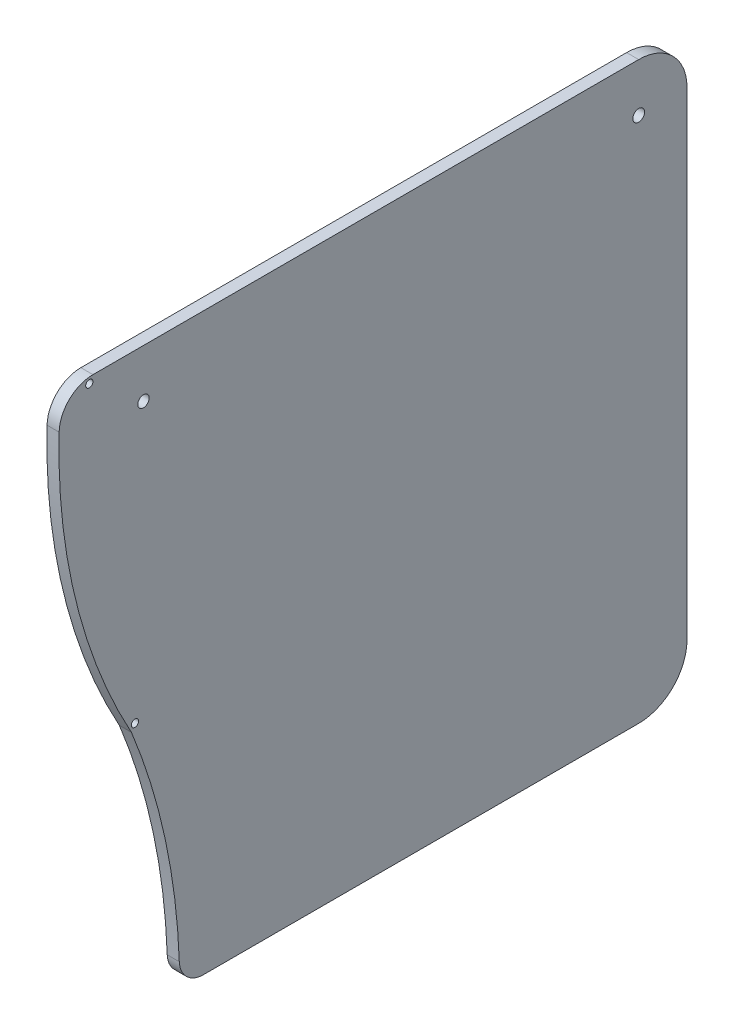
ISO-10303-21;
HEADER;
FILE_DESCRIPTION(('STEP AP214'),'2;1');
FILE_NAME('part.step','',(''),(''),'','','');
FILE_SCHEMA(('AUTOMOTIVE_DESIGN { 1 0 10303 214 1 1 1 1 }'));
ENDSEC;
DATA;
#1=APPLICATION_CONTEXT('core data for automotive mechanical design processes');
#2=APPLICATION_PROTOCOL_DEFINITION('international standard','automotive_design',2000,#1);
#3=PRODUCT_CONTEXT('',#1,'mechanical');
#4=PRODUCT('Part','Part','',(#3));
#5=PRODUCT_RELATED_PRODUCT_CATEGORY('part','',(#4));
#6=PRODUCT_DEFINITION_FORMATION('','',#4);
#7=PRODUCT_DEFINITION_CONTEXT('part definition',#1,'design');
#8=PRODUCT_DEFINITION('design','',#6,#7);
#9=PRODUCT_DEFINITION_SHAPE('','',#8);
#10=(LENGTH_UNIT() NAMED_UNIT(*) SI_UNIT(.MILLI.,.METRE.));
#11=(NAMED_UNIT(*) PLANE_ANGLE_UNIT() SI_UNIT($,.RADIAN.));
#12=(NAMED_UNIT(*) SI_UNIT($,.STERADIAN.) SOLID_ANGLE_UNIT());
#13=UNCERTAINTY_MEASURE_WITH_UNIT(LENGTH_MEASURE(1.E-05),#10,'distance_accuracy_value','');
#14=(GEOMETRIC_REPRESENTATION_CONTEXT(3) GLOBAL_UNCERTAINTY_ASSIGNED_CONTEXT((#13)) GLOBAL_UNIT_ASSIGNED_CONTEXT((#10,
#11,#12)) REPRESENTATION_CONTEXT('',''));
#15=CARTESIAN_POINT('',(0.,0.,0.));
#16=DIRECTION('',(0.,0.,1.));
#17=DIRECTION('',(1.,0.,0.));
#18=AXIS2_PLACEMENT_3D('',#15,#16,#17);
#19=CARTESIAN_POINT('',(3.175,0.,0.));
#20=DIRECTION('',(1.,0.,0.));
#21=DIRECTION('',(0.,0.,-1.));
#22=AXIS2_PLACEMENT_3D('',#19,#20,#21);
#23=PLANE('',#22);
#24=CARTESIAN_POINT('',(3.175,73.9775,74.5619158638602));
#25=DIRECTION('',(1.,0.,0.));
#26=DIRECTION('',(0.,0.,-1.));
#27=AXIS2_PLACEMENT_3D('',#24,#25,#26);
#28=CIRCLE('',#27,0.952499999999996);
#29=CARTESIAN_POINT('',(3.175,73.9775,73.6094158638602));
#30=VERTEX_POINT('',#29);
#31=EDGE_CURVE('E219',#30,#30,#28,.T.);
#32=ORIENTED_EDGE('',*,*,#31,.F.);
#33=EDGE_LOOP('',(#32));
#34=FACE_BOUND('',#33,.T.);
#35=CARTESIAN_POINT('',(3.175,-9.31335011248837,62.5720645796578));
#36=DIRECTION('',(1.,0.,0.));
#37=DIRECTION('',(0.,0.,-1.));
#38=AXIS2_PLACEMENT_3D('',#35,#36,#37);
#39=CIRCLE('',#38,0.952499999999996);
#40=CARTESIAN_POINT('',(3.175,-9.31335011248837,61.6195645796578));
#41=VERTEX_POINT('',#40);
#42=EDGE_CURVE('E213',#41,#41,#39,.T.);
#43=ORIENTED_EDGE('',*,*,#42,.F.);
#44=EDGE_LOOP('',(#43));
#45=FACE_BOUND('',#44,.T.);
#46=CARTESIAN_POINT('',(3.175,62.865,60.325));
#47=DIRECTION('',(1.,0.,0.));
#48=DIRECTION('',(0.,0.,-1.));
#49=AXIS2_PLACEMENT_3D('',#46,#47,#48);
#50=CIRCLE('',#49,1.5);
#51=CARTESIAN_POINT('',(3.175,62.865,58.825));
#52=VERTEX_POINT('',#51);
#53=EDGE_CURVE('E205',#52,#52,#50,.T.);
#54=ORIENTED_EDGE('',*,*,#53,.F.);
#55=EDGE_LOOP('',(#54));
#56=FACE_BOUND('',#55,.T.);
#57=CARTESIAN_POINT('',(3.175,62.865,-69.85));
#58=DIRECTION('',(1.,0.,0.));
#59=DIRECTION('',(0.,0.,-1.));
#60=AXIS2_PLACEMENT_3D('',#57,#58,#59);
#61=CIRCLE('',#60,1.54999999999999);
#62=CARTESIAN_POINT('',(3.175,62.865,-71.4));
#63=VERTEX_POINT('',#62);
#64=EDGE_CURVE('E152',#63,#63,#61,.T.);
#65=ORIENTED_EDGE('',*,*,#64,.F.);
#66=EDGE_LOOP('',(#65));
#67=FACE_BOUND('',#66,.T.);
#68=CARTESIAN_POINT('',(3.175,-75.565,221.70037307676));
#69=DIRECTION('',(1.,0.,0.));
#70=DIRECTION('',(0.,0.,-1.));
#71=AXIS2_PLACEMENT_3D('',#68,#69,#70);
#72=CIRCLE('',#71,170.90037307676);
#73=CARTESIAN_POINT('',(3.175,-69.4424889429008,50.909704783286));
#74=VERTEX_POINT('',#73);
#75=CARTESIAN_POINT('',(3.175,-10.9153327452514,63.5));
#76=VERTEX_POINT('',#75);
#77=EDGE_CURVE('E135',#74,#76,#72,.T.);
#78=ORIENTED_EDGE('',*,*,#77,.F.);
#79=CARTESIAN_POINT('',(3.175,-69.215,44.5637809907355));
#80=DIRECTION('',(1.,0.,0.));
#81=DIRECTION('',(0.,0.,-1.));
#82=AXIS2_PLACEMENT_3D('',#79,#80,#81);
#83=CIRCLE('',#82,6.35);
#84=CARTESIAN_POINT('',(3.175,-75.565,44.5637809907355));
#85=VERTEX_POINT('',#84);
#86=EDGE_CURVE('E77',#74,#85,#83,.T.);
#87=ORIENTED_EDGE('',*,*,#86,.T.);
#88=DIRECTION('',(0.,0.,-1.));
#89=VECTOR('',#88,1.);
#90=CARTESIAN_POINT('',(3.175,-75.565,0.));
#91=LINE('',#90,#89);
#92=CARTESIAN_POINT('',(3.175,-75.565,-69.8500000000001));
#93=VERTEX_POINT('',#92);
#94=EDGE_CURVE('E161',#85,#93,#91,.T.);
#95=ORIENTED_EDGE('',*,*,#94,.T.);
#96=CARTESIAN_POINT('',(3.175,-62.865,-69.8500000000001));
#97=DIRECTION('',(1.,0.,0.));
#98=DIRECTION('',(0.,0.,-1.));
#99=AXIS2_PLACEMENT_3D('',#96,#97,#98);
#100=CIRCLE('',#99,12.7);
#101=CARTESIAN_POINT('',(3.175,-62.865,-82.55));
#102=VERTEX_POINT('',#101);
#103=EDGE_CURVE('E163',#93,#102,#100,.T.);
#104=ORIENTED_EDGE('',*,*,#103,.T.);
#105=DIRECTION('',(0.,-1.,0.));
#106=VECTOR('',#105,1.);
#107=CARTESIAN_POINT('',(3.175,0.,-82.55));
#108=LINE('',#107,#106);
#109=CARTESIAN_POINT('',(3.175,62.865,-82.55));
#110=VERTEX_POINT('',#109);
#111=EDGE_CURVE('E165',#110,#102,#108,.T.);
#112=ORIENTED_EDGE('',*,*,#111,.F.);
#113=CARTESIAN_POINT('',(3.175,62.865,-69.85));
#114=DIRECTION('',(1.,0.,0.));
#115=DIRECTION('',(0.,0.,-1.));
#116=AXIS2_PLACEMENT_3D('',#113,#114,#115);
#117=CIRCLE('',#116,12.7);
#118=CARTESIAN_POINT('',(3.175,75.565,-69.85));
#119=VERTEX_POINT('',#118);
#120=EDGE_CURVE('E155',#110,#119,#117,.T.);
#121=ORIENTED_EDGE('',*,*,#120,.T.);
#122=DIRECTION('',(0.,0.,-1.));
#123=VECTOR('',#122,1.);
#124=CARTESIAN_POINT('',(3.175,75.565,0.));
#125=LINE('',#124,#123);
#126=CARTESIAN_POINT('',(3.175,75.565,73.6094158638603));
#127=VERTEX_POINT('',#126);
#128=EDGE_CURVE('E159',#127,#119,#125,.T.);
#129=ORIENTED_EDGE('',*,*,#128,.F.);
#130=CARTESIAN_POINT('',(3.175,66.675,73.6094158638603));
#131=DIRECTION('',(1.,0.,0.));
#132=DIRECTION('',(0.,0.,-1.));
#133=AXIS2_PLACEMENT_3D('',#130,#131,#132);
#134=CIRCLE('',#133,8.89);
#135=CARTESIAN_POINT('',(3.175,66.911017699115,82.496282333303));
#136=VERTEX_POINT('',#135);
#137=EDGE_CURVE('E195',#127,#136,#134,.T.);
#138=ORIENTED_EDGE('',*,*,#137,.T.);
#139=CARTESIAN_POINT('',(3.175,62.865,-69.85));
#140=DIRECTION('',(1.,0.,0.));
#141=DIRECTION('',(0.,0.,-1.));
#142=AXIS2_PLACEMENT_3D('',#139,#140,#141);
#143=CIRCLE('',#142,152.4);
#144=EDGE_CURVE('E144',#136,#76,#143,.T.);
#145=ORIENTED_EDGE('',*,*,#144,.T.);
#146=EDGE_LOOP('',(#78,#87,#95,#104,#112,#121,#129,#138,#145));
#147=FACE_BOUND('',#146,.T.);
#148=ADVANCED_FACE('F55',(#34,#45,#56,#67,#147),#23,.T.);
#149=CARTESIAN_POINT('',(0.,0.,0.));
#150=DIRECTION('',(1.,0.,0.));
#151=DIRECTION('',(0.,0.,-1.));
#152=AXIS2_PLACEMENT_3D('',#149,#150,#151);
#153=PLANE('',#152);
#154=CARTESIAN_POINT('',(0.,73.9775,74.5619158638602));
#155=DIRECTION('',(1.,0.,0.));
#156=DIRECTION('',(0.,0.,-1.));
#157=AXIS2_PLACEMENT_3D('',#154,#155,#156);
#158=CIRCLE('',#157,0.952499999999996);
#159=CARTESIAN_POINT('',(0.,73.9775,73.6094158638602));
#160=VERTEX_POINT('',#159);
#161=EDGE_CURVE('E210',#160,#160,#158,.T.);
#162=ORIENTED_EDGE('',*,*,#161,.T.);
#163=EDGE_LOOP('',(#162));
#164=FACE_BOUND('',#163,.T.);
#165=CARTESIAN_POINT('',(0.,-9.31335011248837,62.5720645796578));
#166=DIRECTION('',(1.,0.,0.));
#167=DIRECTION('',(0.,0.,-1.));
#168=AXIS2_PLACEMENT_3D('',#165,#166,#167);
#169=CIRCLE('',#168,0.952499999999996);
#170=CARTESIAN_POINT('',(0.,-9.31335011248837,61.6195645796578));
#171=VERTEX_POINT('',#170);
#172=EDGE_CURVE('E216',#171,#171,#169,.T.);
#173=ORIENTED_EDGE('',*,*,#172,.T.);
#174=EDGE_LOOP('',(#173));
#175=FACE_BOUND('',#174,.T.);
#176=CARTESIAN_POINT('',(0.,62.865,60.325));
#177=DIRECTION('',(1.,0.,0.));
#178=DIRECTION('',(0.,0.,-1.));
#179=AXIS2_PLACEMENT_3D('',#176,#177,#178);
#180=CIRCLE('',#179,1.5);
#181=CARTESIAN_POINT('',(0.,62.865,58.825));
#182=VERTEX_POINT('',#181);
#183=EDGE_CURVE('E203',#182,#182,#180,.T.);
#184=ORIENTED_EDGE('',*,*,#183,.T.);
#185=EDGE_LOOP('',(#184));
#186=FACE_BOUND('',#185,.T.);
#187=CARTESIAN_POINT('',(0.,62.865,-69.85));
#188=DIRECTION('',(1.,0.,0.));
#189=DIRECTION('',(0.,0.,-1.));
#190=AXIS2_PLACEMENT_3D('',#187,#188,#189);
#191=CIRCLE('',#190,1.54999999999999);
#192=CARTESIAN_POINT('',(0.,62.865,-71.4));
#193=VERTEX_POINT('',#192);
#194=EDGE_CURVE('E143',#193,#193,#191,.T.);
#195=ORIENTED_EDGE('',*,*,#194,.T.);
#196=EDGE_LOOP('',(#195));
#197=FACE_BOUND('',#196,.T.);
#198=DIRECTION('',(0.,0.,-1.));
#199=VECTOR('',#198,1.);
#200=CARTESIAN_POINT('',(0.,-75.565,0.));
#201=LINE('',#200,#199);
#202=CARTESIAN_POINT('',(0.,-75.565,44.5637809907355));
#203=VERTEX_POINT('',#202);
#204=CARTESIAN_POINT('',(0.,-75.565,-69.8500000000001));
#205=VERTEX_POINT('',#204);
#206=EDGE_CURVE('E176',#203,#205,#201,.T.);
#207=ORIENTED_EDGE('',*,*,#206,.F.);
#208=CARTESIAN_POINT('',(0.,-69.215,44.5637809907355));
#209=DIRECTION('',(1.,0.,0.));
#210=DIRECTION('',(0.,0.,-1.));
#211=AXIS2_PLACEMENT_3D('',#208,#209,#210);
#212=CIRCLE('',#211,6.35);
#213=CARTESIAN_POINT('',(0.,-69.4424889429008,50.909704783286));
#214=VERTEX_POINT('',#213);
#215=EDGE_CURVE('E12',#203,#214,#212,.F.);
#216=ORIENTED_EDGE('',*,*,#215,.T.);
#217=CARTESIAN_POINT('',(0.,-75.565,221.70037307676));
#218=DIRECTION('',(1.,0.,0.));
#219=DIRECTION('',(0.,0.,-1.));
#220=AXIS2_PLACEMENT_3D('',#217,#218,#219);
#221=CIRCLE('',#220,170.90037307676);
#222=CARTESIAN_POINT('',(0.,-10.9153327452514,63.5));
#223=VERTEX_POINT('',#222);
#224=EDGE_CURVE('E124',#214,#223,#221,.T.);
#225=ORIENTED_EDGE('',*,*,#224,.T.);
#226=CARTESIAN_POINT('',(0.,62.865,-69.85));
#227=DIRECTION('',(1.,0.,0.));
#228=DIRECTION('',(0.,0.,-1.));
#229=AXIS2_PLACEMENT_3D('',#226,#227,#228);
#230=CIRCLE('',#229,152.4);
#231=CARTESIAN_POINT('',(0.,66.911017699115,82.496282333303));
#232=VERTEX_POINT('',#231);
#233=EDGE_CURVE('E127',#232,#223,#230,.T.);
#234=ORIENTED_EDGE('',*,*,#233,.F.);
#235=CARTESIAN_POINT('',(0.,66.675,73.6094158638603));
#236=DIRECTION('',(1.,0.,0.));
#237=DIRECTION('',(0.,0.,-1.));
#238=AXIS2_PLACEMENT_3D('',#235,#236,#237);
#239=CIRCLE('',#238,8.89);
#240=CARTESIAN_POINT('',(0.,75.565,73.6094158638603));
#241=VERTEX_POINT('',#240);
#242=EDGE_CURVE('E198',#232,#241,#239,.F.);
#243=ORIENTED_EDGE('',*,*,#242,.T.);
#244=DIRECTION('',(0.,0.,-1.));
#245=VECTOR('',#244,1.);
#246=CARTESIAN_POINT('',(0.,75.565,0.));
#247=LINE('',#246,#245);
#248=CARTESIAN_POINT('',(0.,75.565,-69.85));
#249=VERTEX_POINT('',#248);
#250=EDGE_CURVE('E174',#241,#249,#247,.T.);
#251=ORIENTED_EDGE('',*,*,#250,.T.);
#252=CARTESIAN_POINT('',(0.,62.865,-69.85));
#253=DIRECTION('',(1.,0.,0.));
#254=DIRECTION('',(0.,0.,-1.));
#255=AXIS2_PLACEMENT_3D('',#252,#253,#254);
#256=CIRCLE('',#255,12.7);
#257=CARTESIAN_POINT('',(0.,62.865,-82.55));
#258=VERTEX_POINT('',#257);
#259=EDGE_CURVE('E171',#258,#249,#256,.T.);
#260=ORIENTED_EDGE('',*,*,#259,.F.);
#261=DIRECTION('',(0.,-1.,0.));
#262=VECTOR('',#261,1.);
#263=CARTESIAN_POINT('',(0.,0.,-82.55));
#264=LINE('',#263,#262);
#265=CARTESIAN_POINT('',(0.,-62.865,-82.55));
#266=VERTEX_POINT('',#265);
#267=EDGE_CURVE('E156',#258,#266,#264,.T.);
#268=ORIENTED_EDGE('',*,*,#267,.T.);
#269=CARTESIAN_POINT('',(0.,-62.865,-69.8500000000001));
#270=DIRECTION('',(1.,0.,0.));
#271=DIRECTION('',(0.,0.,-1.));
#272=AXIS2_PLACEMENT_3D('',#269,#270,#271);
#273=CIRCLE('',#272,12.7);
#274=EDGE_CURVE('E178',#205,#266,#273,.T.);
#275=ORIENTED_EDGE('',*,*,#274,.F.);
#276=EDGE_LOOP('',(#207,#216,#225,#234,#243,#251,#260,#268,#275));
#277=FACE_BOUND('',#276,.T.);
#278=ADVANCED_FACE('F126',(#164,#175,#186,#197,#277),#153,.F.);
#279=CARTESIAN_POINT('',(3.175,75.565,0.));
#280=DIRECTION('',(0.,1.,0.));
#281=DIRECTION('',(0.,0.,1.));
#282=AXIS2_PLACEMENT_3D('',#279,#280,#281);
#283=PLANE('',#282);
#284=ORIENTED_EDGE('',*,*,#250,.F.);
#285=DIRECTION('',(1.,0.,0.));
#286=VECTOR('',#285,1.);
#287=CARTESIAN_POINT('',(3.175,75.565,73.6094158638603));
#288=LINE('',#287,#286);
#289=EDGE_CURVE('E192',#241,#127,#288,.T.);
#290=ORIENTED_EDGE('',*,*,#289,.T.);
#291=ORIENTED_EDGE('',*,*,#128,.T.);
#292=DIRECTION('',(-1.,0.,0.));
#293=VECTOR('',#292,1.);
#294=CARTESIAN_POINT('',(3.175,75.565,-69.85));
#295=LINE('',#294,#293);
#296=EDGE_CURVE('E189',#119,#249,#295,.T.);
#297=ORIENTED_EDGE('',*,*,#296,.T.);
#298=EDGE_LOOP('',(#284,#290,#291,#297));
#299=FACE_BOUND('',#298,.T.);
#300=ADVANCED_FACE('F252',(#299),#283,.T.);
#301=CARTESIAN_POINT('',(3.175,62.865,-69.85));
#302=DIRECTION('',(-1.,0.,0.));
#303=DIRECTION('',(0.,0.,1.));
#304=AXIS2_PLACEMENT_3D('',#301,#302,#303);
#305=CYLINDRICAL_SURFACE('',#304,12.7);
#306=ORIENTED_EDGE('',*,*,#259,.T.);
#307=ORIENTED_EDGE('',*,*,#296,.F.);
#308=ORIENTED_EDGE('',*,*,#120,.F.);
#309=DIRECTION('',(-1.,0.,0.));
#310=VECTOR('',#309,1.);
#311=CARTESIAN_POINT('',(3.175,62.865,-82.55));
#312=LINE('',#311,#310);
#313=EDGE_CURVE('E168',#110,#258,#312,.T.);
#314=ORIENTED_EDGE('',*,*,#313,.T.);
#315=EDGE_LOOP('',(#306,#307,#308,#314));
#316=FACE_BOUND('',#315,.T.);
#317=ADVANCED_FACE('F257',(#316),#305,.T.);
#318=CARTESIAN_POINT('',(3.175,-75.565,0.));
#319=DIRECTION('',(0.,1.,0.));
#320=DIRECTION('',(0.,0.,1.));
#321=AXIS2_PLACEMENT_3D('',#318,#319,#320);
#322=PLANE('',#321);
#323=ORIENTED_EDGE('',*,*,#94,.F.);
#324=DIRECTION('',(1.,0.,0.));
#325=VECTOR('',#324,1.);
#326=CARTESIAN_POINT('',(3.175,-75.565,44.5637809907355));
#327=LINE('',#326,#325);
#328=EDGE_CURVE('E63',#85,#203,#327,.F.);
#329=ORIENTED_EDGE('',*,*,#328,.T.);
#330=ORIENTED_EDGE('',*,*,#206,.T.);
#331=DIRECTION('',(-1.,0.,0.));
#332=VECTOR('',#331,1.);
#333=CARTESIAN_POINT('',(3.175,-75.565,-69.8500000000001));
#334=LINE('',#333,#332);
#335=EDGE_CURVE('E186',#93,#205,#334,.T.);
#336=ORIENTED_EDGE('',*,*,#335,.F.);
#337=EDGE_LOOP('',(#323,#329,#330,#336));
#338=FACE_BOUND('',#337,.T.);
#339=ADVANCED_FACE('F267',(#338),#322,.F.);
#340=CARTESIAN_POINT('',(3.175,-62.865,-69.8500000000001));
#341=DIRECTION('',(-1.,0.,0.));
#342=DIRECTION('',(0.,0.,1.));
#343=AXIS2_PLACEMENT_3D('',#340,#341,#342);
#344=CYLINDRICAL_SURFACE('',#343,12.7);
#345=ORIENTED_EDGE('',*,*,#274,.T.);
#346=DIRECTION('',(-1.,0.,0.));
#347=VECTOR('',#346,1.);
#348=CARTESIAN_POINT('',(3.175,-62.865,-82.55));
#349=LINE('',#348,#347);
#350=EDGE_CURVE('E184',#102,#266,#349,.T.);
#351=ORIENTED_EDGE('',*,*,#350,.F.);
#352=ORIENTED_EDGE('',*,*,#103,.F.);
#353=ORIENTED_EDGE('',*,*,#335,.T.);
#354=EDGE_LOOP('',(#345,#351,#352,#353));
#355=FACE_BOUND('',#354,.T.);
#356=ADVANCED_FACE('F247',(#355),#344,.T.);
#357=CARTESIAN_POINT('',(3.175,62.865,-69.85));
#358=DIRECTION('',(-1.,0.,0.));
#359=DIRECTION('',(0.,0.,1.));
#360=AXIS2_PLACEMENT_3D('',#357,#358,#359);
#361=CYLINDRICAL_SURFACE('',#360,1.54999999999999);
#362=ORIENTED_EDGE('',*,*,#64,.T.);
#363=EDGE_LOOP('',(#362));
#364=FACE_BOUND('',#363,.T.);
#365=ORIENTED_EDGE('',*,*,#194,.F.);
#366=EDGE_LOOP('',(#365));
#367=FACE_BOUND('',#366,.T.);
#368=ADVANCED_FACE('F243',(#364,#367),#361,.F.);
#369=CARTESIAN_POINT('',(3.175,0.,-82.55));
#370=DIRECTION('',(0.,0.,-1.));
#371=DIRECTION('',(-1.,0.,0.));
#372=AXIS2_PLACEMENT_3D('',#369,#370,#371);
#373=PLANE('',#372);
#374=ORIENTED_EDGE('',*,*,#267,.F.);
#375=ORIENTED_EDGE('',*,*,#313,.F.);
#376=ORIENTED_EDGE('',*,*,#111,.T.);
#377=ORIENTED_EDGE('',*,*,#350,.T.);
#378=EDGE_LOOP('',(#374,#375,#376,#377));
#379=FACE_BOUND('',#378,.T.);
#380=ADVANCED_FACE('F246',(#379),#373,.T.);
#381=CARTESIAN_POINT('',(0.,62.865,-69.85));
#382=DIRECTION('',(1.,0.,0.));
#383=DIRECTION('',(0.,0.,-1.));
#384=AXIS2_PLACEMENT_3D('',#381,#382,#383);
#385=CYLINDRICAL_SURFACE('',#384,152.4);
#386=ORIENTED_EDGE('',*,*,#144,.F.);
#387=DIRECTION('',(1.,0.,0.));
#388=VECTOR('',#387,1.);
#389=CARTESIAN_POINT('',(0.,66.911017699115,82.496282333303));
#390=LINE('',#389,#388);
#391=EDGE_CURVE('E142',#136,#232,#390,.F.);
#392=ORIENTED_EDGE('',*,*,#391,.T.);
#393=ORIENTED_EDGE('',*,*,#233,.T.);
#394=DIRECTION('',(1.,0.,0.));
#395=VECTOR('',#394,1.);
#396=CARTESIAN_POINT('',(0.,-10.9153327452514,63.5));
#397=LINE('',#396,#395);
#398=EDGE_CURVE('E134',#223,#76,#397,.T.);
#399=ORIENTED_EDGE('',*,*,#398,.T.);
#400=EDGE_LOOP('',(#386,#392,#393,#399));
#401=FACE_BOUND('',#400,.T.);
#402=ADVANCED_FACE('F140',(#401),#385,.T.);
#403=CARTESIAN_POINT('',(0.,-75.565,221.70037307676));
#404=DIRECTION('',(1.,0.,0.));
#405=DIRECTION('',(0.,0.,-1.));
#406=AXIS2_PLACEMENT_3D('',#403,#404,#405);
#407=CYLINDRICAL_SURFACE('',#406,170.90037307676);
#408=ORIENTED_EDGE('',*,*,#224,.F.);
#409=DIRECTION('',(1.,0.,0.));
#410=VECTOR('',#409,1.);
#411=CARTESIAN_POINT('',(0.,-69.4424889429008,50.909704783286));
#412=LINE('',#411,#410);
#413=EDGE_CURVE('E200',#214,#74,#412,.T.);
#414=ORIENTED_EDGE('',*,*,#413,.T.);
#415=ORIENTED_EDGE('',*,*,#77,.T.);
#416=ORIENTED_EDGE('',*,*,#398,.F.);
#417=EDGE_LOOP('',(#408,#414,#415,#416));
#418=FACE_BOUND('',#417,.T.);
#419=ADVANCED_FACE('F146',(#418),#407,.F.);
#420=CARTESIAN_POINT('',(0.,66.675,73.6094158638603));
#421=DIRECTION('',(1.,0.,0.));
#422=DIRECTION('',(0.,0.,-1.));
#423=AXIS2_PLACEMENT_3D('',#420,#421,#422);
#424=CYLINDRICAL_SURFACE('',#423,8.89);
#425=ORIENTED_EDGE('',*,*,#242,.F.);
#426=ORIENTED_EDGE('',*,*,#391,.F.);
#427=ORIENTED_EDGE('',*,*,#137,.F.);
#428=ORIENTED_EDGE('',*,*,#289,.F.);
#429=EDGE_LOOP('',(#425,#426,#427,#428));
#430=FACE_BOUND('',#429,.T.);
#431=ADVANCED_FACE('F273',(#430),#424,.T.);
#432=CARTESIAN_POINT('',(0.,62.865,60.325));
#433=DIRECTION('',(1.,0.,0.));
#434=DIRECTION('',(0.,0.,-1.));
#435=AXIS2_PLACEMENT_3D('',#432,#433,#434);
#436=CYLINDRICAL_SURFACE('',#435,1.5);
#437=ORIENTED_EDGE('',*,*,#183,.F.);
#438=EDGE_LOOP('',(#437));
#439=FACE_BOUND('',#438,.T.);
#440=ORIENTED_EDGE('',*,*,#53,.T.);
#441=EDGE_LOOP('',(#440));
#442=FACE_BOUND('',#441,.T.);
#443=ADVANCED_FACE('F275',(#439,#442),#436,.F.);
#444=CARTESIAN_POINT('',(0.,-9.31335011248837,62.5720645796578));
#445=DIRECTION('',(1.,0.,0.));
#446=DIRECTION('',(0.,0.,-1.));
#447=AXIS2_PLACEMENT_3D('',#444,#445,#446);
#448=CYLINDRICAL_SURFACE('',#447,0.952499999999996);
#449=ORIENTED_EDGE('',*,*,#172,.F.);
#450=EDGE_LOOP('',(#449));
#451=FACE_BOUND('',#450,.T.);
#452=ORIENTED_EDGE('',*,*,#42,.T.);
#453=EDGE_LOOP('',(#452));
#454=FACE_BOUND('',#453,.T.);
#455=ADVANCED_FACE('F230',(#451,#454),#448,.F.);
#456=CARTESIAN_POINT('',(0.,73.9775,74.5619158638602));
#457=DIRECTION('',(1.,0.,0.));
#458=DIRECTION('',(0.,0.,-1.));
#459=AXIS2_PLACEMENT_3D('',#456,#457,#458);
#460=CYLINDRICAL_SURFACE('',#459,0.952499999999996);
#461=ORIENTED_EDGE('',*,*,#161,.F.);
#462=EDGE_LOOP('',(#461));
#463=FACE_BOUND('',#462,.T.);
#464=ORIENTED_EDGE('',*,*,#31,.T.);
#465=EDGE_LOOP('',(#464));
#466=FACE_BOUND('',#465,.T.);
#467=ADVANCED_FACE('F227',(#463,#466),#460,.F.);
#468=CARTESIAN_POINT('',(0.,-69.215,44.5637809907355));
#469=DIRECTION('',(1.,0.,0.));
#470=DIRECTION('',(0.,0.,-1.));
#471=AXIS2_PLACEMENT_3D('',#468,#469,#470);
#472=CYLINDRICAL_SURFACE('',#471,6.35);
#473=ORIENTED_EDGE('',*,*,#215,.F.);
#474=ORIENTED_EDGE('',*,*,#328,.F.);
#475=ORIENTED_EDGE('',*,*,#86,.F.);
#476=ORIENTED_EDGE('',*,*,#413,.F.);
#477=EDGE_LOOP('',(#473,#474,#475,#476));
#478=FACE_BOUND('',#477,.T.);
#479=ADVANCED_FACE('F57',(#478),#472,.T.);
#480=CLOSED_SHELL('',(#148,#278,#300,#317,#339,#356,#368,#380,#402,#419,#431,#443,#455,#467,#479));
#481=MANIFOLD_SOLID_BREP('B2',#480);
#482=ADVANCED_BREP_SHAPE_REPRESENTATION('',(#18,#481),#14);
#483=SHAPE_DEFINITION_REPRESENTATION(#9,#482);
ENDSEC;
END-ISO-10303-21;
